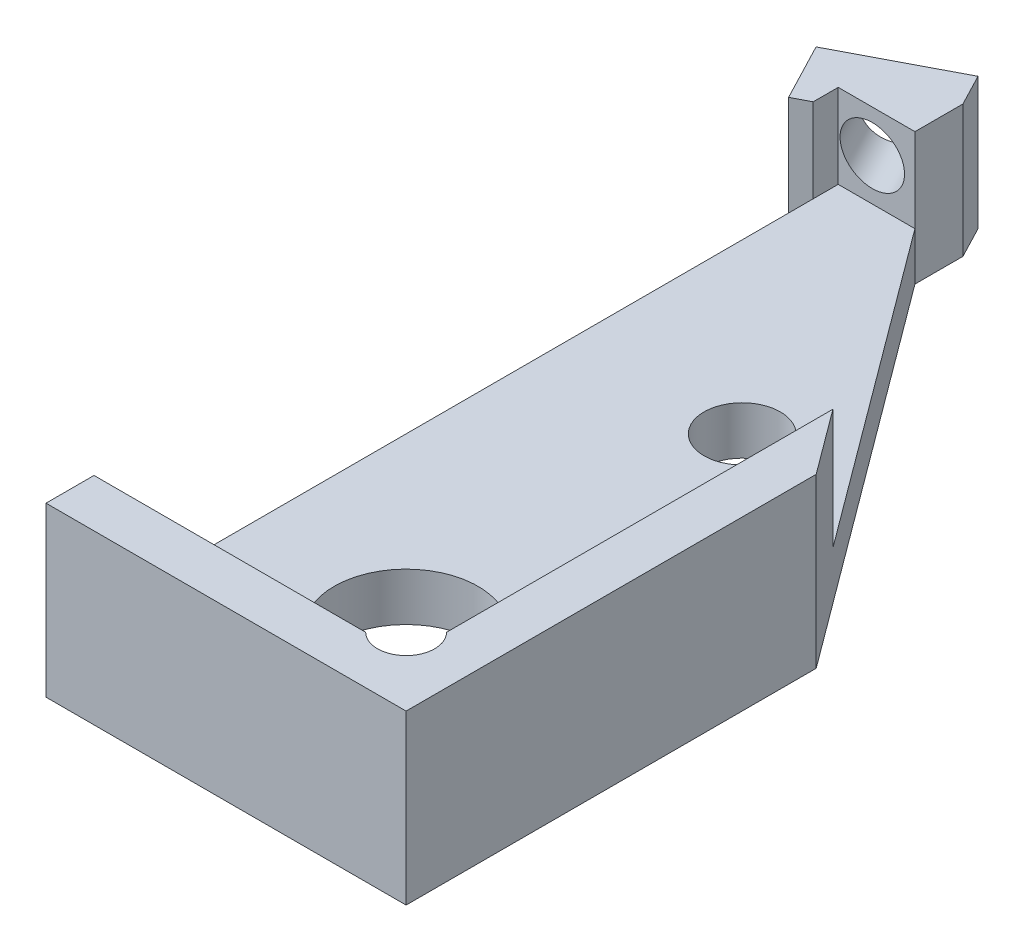
ISO-10303-21;
HEADER;
FILE_DESCRIPTION(('STEP AP214'),'2;1');
FILE_NAME('part.step','',(''),(''),'','','');
FILE_SCHEMA(('AUTOMOTIVE_DESIGN { 1 0 10303 214 1 1 1 1 }'));
ENDSEC;
DATA;
#1=APPLICATION_CONTEXT('core data for automotive mechanical design processes');
#2=APPLICATION_PROTOCOL_DEFINITION('international standard','automotive_design',2000,#1);
#3=PRODUCT_CONTEXT('',#1,'mechanical');
#4=PRODUCT('Part','Part','',(#3));
#5=PRODUCT_RELATED_PRODUCT_CATEGORY('part','',(#4));
#6=PRODUCT_DEFINITION_FORMATION('','',#4);
#7=PRODUCT_DEFINITION_CONTEXT('part definition',#1,'design');
#8=PRODUCT_DEFINITION('design','',#6,#7);
#9=PRODUCT_DEFINITION_SHAPE('','',#8);
#10=(LENGTH_UNIT() NAMED_UNIT(*) SI_UNIT(.MILLI.,.METRE.));
#11=(NAMED_UNIT(*) PLANE_ANGLE_UNIT() SI_UNIT($,.RADIAN.));
#12=(NAMED_UNIT(*) SI_UNIT($,.STERADIAN.) SOLID_ANGLE_UNIT());
#13=UNCERTAINTY_MEASURE_WITH_UNIT(LENGTH_MEASURE(1.E-05),#10,'distance_accuracy_value','');
#14=(GEOMETRIC_REPRESENTATION_CONTEXT(3) GLOBAL_UNCERTAINTY_ASSIGNED_CONTEXT((#13)) GLOBAL_UNIT_ASSIGNED_CONTEXT((#10,
#11,#12)) REPRESENTATION_CONTEXT('',''));
#15=CARTESIAN_POINT('',(0.,0.,0.));
#16=DIRECTION('',(0.,0.,1.));
#17=DIRECTION('',(1.,0.,0.));
#18=AXIS2_PLACEMENT_3D('',#15,#16,#17);
#19=CARTESIAN_POINT('',(0.,3.5,0.));
#20=DIRECTION('',(0.,-1.,0.));
#21=DIRECTION('',(0.,0.,-1.));
#22=AXIS2_PLACEMENT_3D('',#19,#20,#21);
#23=PLANE('',#22);
#24=DIRECTION('',(1.,0.,0.));
#25=VECTOR('',#24,1.);
#26=CARTESIAN_POINT('',(2.75,3.5,7.75));
#27=LINE('',#26,#25);
#28=CARTESIAN_POINT('',(-3.75,3.5,7.75));
#29=VERTEX_POINT('',#28);
#30=CARTESIAN_POINT('',(1.90810098864976,3.5,7.75));
#31=VERTEX_POINT('',#30);
#32=EDGE_CURVE('E255',#29,#31,#27,.T.);
#33=ORIENTED_EDGE('',*,*,#32,.F.);
#34=DIRECTION('',(0.,0.,1.));
#35=VECTOR('',#34,1.);
#36=CARTESIAN_POINT('',(-3.75,3.5,-8.75));
#37=LINE('',#36,#35);
#38=CARTESIAN_POINT('',(-3.75,3.5,8.75));
#39=VERTEX_POINT('',#38);
#40=EDGE_CURVE('E267',#29,#39,#37,.T.);
#41=ORIENTED_EDGE('',*,*,#40,.T.);
#42=DIRECTION('',(1.,0.,0.));
#43=VECTOR('',#42,1.);
#44=CARTESIAN_POINT('',(3.75,3.5,8.75));
#45=LINE('',#44,#43);
#46=CARTESIAN_POINT('',(3.75,3.5,8.75));
#47=VERTEX_POINT('',#46);
#48=EDGE_CURVE('E269',#39,#47,#45,.T.);
#49=ORIENTED_EDGE('',*,*,#48,.T.);
#50=DIRECTION('',(0.,0.,-1.));
#51=VECTOR('',#50,1.);
#52=CARTESIAN_POINT('',(3.75,3.5,-8.75));
#53=LINE('',#52,#51);
#54=CARTESIAN_POINT('',(3.75,3.5,0.208562074203243));
#55=VERTEX_POINT('',#54);
#56=EDGE_CURVE('E272',#47,#55,#53,.T.);
#57=ORIENTED_EDGE('',*,*,#56,.T.);
#58=DIRECTION('',(0.595668713356042,0.,0.803230218510707));
#59=VECTOR('',#58,1.);
#60=CARTESIAN_POINT('',(2.31963201516526,3.5,-1.72021941666348));
#61=LINE('',#60,#59);
#62=CARTESIAN_POINT('',(2.75,3.5,-1.13988917143168));
#63=VERTEX_POINT('',#62);
#64=EDGE_CURVE('E189',#63,#55,#61,.T.);
#65=ORIENTED_EDGE('',*,*,#64,.F.);
#66=DIRECTION('',(0.,0.,-1.));
#67=VECTOR('',#66,1.);
#68=CARTESIAN_POINT('',(2.75,3.5,-7.75));
#69=LINE('',#68,#67);
#70=CARTESIAN_POINT('',(2.75,3.5,6.90810098864977));
#71=VERTEX_POINT('',#70);
#72=EDGE_CURVE('E258',#71,#63,#69,.T.);
#73=ORIENTED_EDGE('',*,*,#72,.F.);
#74=CARTESIAN_POINT('',(2.32905049432488,3.5,7.32905049432488));
#75=DIRECTION('',(0.,1.,0.));
#76=DIRECTION('',(0.,0.,1.));
#77=AXIS2_PLACEMENT_3D('',#74,#75,#76);
#78=CIRCLE('',#77,0.595312500000001);
#79=EDGE_CURVE('E57',#31,#71,#78,.T.);
#80=ORIENTED_EDGE('',*,*,#79,.F.);
#81=EDGE_LOOP('',(#33,#41,#49,#57,#65,#73,#80));
#82=FACE_BOUND('',#81,.T.);
#83=ADVANCED_FACE('F34',(#82),#23,.F.);
#84=CARTESIAN_POINT('',(0.,2.75,0.));
#85=DIRECTION('',(0.,-1.,0.));
#86=DIRECTION('',(0.,0.,-1.));
#87=AXIS2_PLACEMENT_3D('',#84,#85,#86);
#88=PLANE('',#87);
#89=DIRECTION('',(0.,0.,1.));
#90=VECTOR('',#89,1.);
#91=CARTESIAN_POINT('',(-3.75,2.75,0.));
#92=LINE('',#91,#90);
#93=CARTESIAN_POINT('',(-3.75,2.75,-7.75));
#94=VERTEX_POINT('',#93);
#95=CARTESIAN_POINT('',(-3.75,2.75,-7.22820528636593));
#96=VERTEX_POINT('',#95);
#97=EDGE_CURVE('E163',#94,#96,#92,.T.);
#98=ORIENTED_EDGE('',*,*,#97,.F.);
#99=DIRECTION('',(-1.,0.,0.));
#100=VECTOR('',#99,1.);
#101=CARTESIAN_POINT('',(2.75,2.75,-7.75));
#102=LINE('',#101,#100);
#103=CARTESIAN_POINT('',(-2.15200209311677,2.75,-7.75));
#104=VERTEX_POINT('',#103);
#105=EDGE_CURVE('E160',#104,#94,#102,.T.);
#106=ORIENTED_EDGE('',*,*,#105,.F.);
#107=DIRECTION('',(0.,0.,1.));
#108=VECTOR('',#107,1.);
#109=CARTESIAN_POINT('',(-2.15200209311678,2.75,0.));
#110=LINE('',#109,#108);
#111=CARTESIAN_POINT('',(-2.15200209311677,2.75,-8.75));
#112=VERTEX_POINT('',#111);
#113=EDGE_CURVE('E12',#112,#104,#110,.T.);
#114=ORIENTED_EDGE('',*,*,#113,.F.);
#115=DIRECTION('',(-0.462604740450131,0.,-0.886564636173284));
#116=VECTOR('',#115,1.);
#117=CARTESIAN_POINT('',(-2.49397867231052,2.75,-9.40538528900002));
#118=LINE('',#117,#116);
#119=CARTESIAN_POINT('',(-2.49397867231052,2.75,-9.40538528900002));
#120=VERTEX_POINT('',#119);
#121=EDGE_CURVE('E201',#112,#120,#118,.T.);
#122=ORIENTED_EDGE('',*,*,#121,.T.);
#123=DIRECTION('',(-0.886564636173283,0.,0.462604740450132));
#124=VECTOR('',#123,1.);
#125=CARTESIAN_POINT('',(-2.49397867231052,2.75,-9.40538528900002));
#126=LINE('',#125,#124);
#127=CARTESIAN_POINT('',(-4.71039026274373,2.75,-8.24887343787469));
#128=VERTEX_POINT('',#127);
#129=EDGE_CURVE('E49',#120,#128,#126,.T.);
#130=ORIENTED_EDGE('',*,*,#129,.T.);
#131=DIRECTION('',(0.462604740450133,0.,0.886564636173283));
#132=VECTOR('',#131,1.);
#133=CARTESIAN_POINT('',(-4.08625811344759,2.75,-7.05274758035242));
#134=LINE('',#133,#132);
#135=CARTESIAN_POINT('',(-4.08625811344759,2.75,-7.05274758035242));
#136=VERTEX_POINT('',#135);
#137=EDGE_CURVE('E42',#128,#136,#134,.T.);
#138=ORIENTED_EDGE('',*,*,#137,.T.);
#139=DIRECTION('',(0.886564636173283,0.,-0.462604740450133));
#140=VECTOR('',#139,1.);
#141=CARTESIAN_POINT('',(-1.86984652301438,2.75,-8.20925943147775));
#142=LINE('',#141,#140);
#143=EDGE_CURVE('E197',#136,#96,#142,.T.);
#144=ORIENTED_EDGE('',*,*,#143,.T.);
#145=EDGE_LOOP('',(#98,#106,#114,#122,#130,#138,#144));
#146=FACE_BOUND('',#145,.T.);
#147=ADVANCED_FACE('F288',(#146),#88,.F.);
#148=CARTESIAN_POINT('',(-3.75,3.5,-8.75));
#149=DIRECTION('',(1.,0.,0.));
#150=DIRECTION('',(0.,0.,-1.));
#151=AXIS2_PLACEMENT_3D('',#148,#149,#150);
#152=PLANE('',#151);
#153=DIRECTION('',(0.,-1.,0.));
#154=VECTOR('',#153,1.);
#155=CARTESIAN_POINT('',(-3.75,4.,7.75));
#156=LINE('',#155,#154);
#157=CARTESIAN_POINT('',(-3.75,1.,7.75));
#158=VERTEX_POINT('',#157);
#159=EDGE_CURVE('E164',#29,#158,#156,.T.);
#160=ORIENTED_EDGE('',*,*,#159,.T.);
#161=DIRECTION('',(0.,0.,1.));
#162=VECTOR('',#161,1.);
#163=CARTESIAN_POINT('',(-3.75,1.,7.75));
#164=LINE('',#163,#162);
#165=CARTESIAN_POINT('',(-3.75,1.,-7.22820528636593));
#166=VERTEX_POINT('',#165);
#167=EDGE_CURVE('E169',#166,#158,#164,.T.);
#168=ORIENTED_EDGE('',*,*,#167,.F.);
#169=DIRECTION('',(0.,-1.,0.));
#170=VECTOR('',#169,1.);
#171=CARTESIAN_POINT('',(-3.75,3.5,-7.22820528636593));
#172=LINE('',#171,#170);
#173=CARTESIAN_POINT('',(-3.75,0.,-7.22820528636593));
#174=VERTEX_POINT('',#173);
#175=EDGE_CURVE('E223',#166,#174,#172,.T.);
#176=ORIENTED_EDGE('',*,*,#175,.T.);
#177=DIRECTION('',(0.,0.,1.));
#178=VECTOR('',#177,1.);
#179=CARTESIAN_POINT('',(-3.75,0.,-8.75));
#180=LINE('',#179,#178);
#181=CARTESIAN_POINT('',(-3.75,0.,8.75));
#182=VERTEX_POINT('',#181);
#183=EDGE_CURVE('E153',#174,#182,#180,.T.);
#184=ORIENTED_EDGE('',*,*,#183,.T.);
#185=DIRECTION('',(0.,-1.,0.));
#186=VECTOR('',#185,1.);
#187=CARTESIAN_POINT('',(-3.75,3.5,8.75));
#188=LINE('',#187,#186);
#189=EDGE_CURVE('E283',#39,#182,#188,.T.);
#190=ORIENTED_EDGE('',*,*,#189,.F.);
#191=ORIENTED_EDGE('',*,*,#40,.F.);
#192=EDGE_LOOP('',(#160,#168,#176,#184,#190,#191));
#193=FACE_BOUND('',#192,.T.);
#194=ADVANCED_FACE('F36',(#193),#152,.F.);
#195=CARTESIAN_POINT('',(-3.60218446752712,1.875,-8.82712936343735));
#196=DIRECTION('',(-0.462604740450132,0.,-0.886564636173283));
#197=DIRECTION('',(-0.886564636173283,0.,0.462604740450132));
#198=AXIS2_PLACEMENT_3D('',#195,#196,#197);
#199=CYLINDRICAL_SURFACE('',#198,0.595629999999999);
#200=CARTESIAN_POINT('',(-3.60218446752712,1.875,-8.82712936343735));
#201=DIRECTION('',(-0.462604740450132,0.,-0.886564636173283));
#202=DIRECTION('',(-0.886564636173283,0.,0.462604740450132));
#203=AXIS2_PLACEMENT_3D('',#200,#201,#202);
#204=CIRCLE('',#203,0.595629999999999);
#205=CARTESIAN_POINT('',(-4.13024896177101,1.875,-8.55158810188304));
#206=VERTEX_POINT('',#205);
#207=EDGE_CURVE('E191',#206,#206,#204,.T.);
#208=ORIENTED_EDGE('',*,*,#207,.T.);
#209=EDGE_LOOP('',(#208));
#210=FACE_BOUND('',#209,.T.);
#211=CARTESIAN_POINT('',(-3.04014405978548,1.875,-7.75));
#212=DIRECTION('',(0.,0.,-1.));
#213=DIRECTION('',(-1.,0.,0.));
#214=AXIS2_PLACEMENT_3D('',#211,#212,#213);
#215=ELLIPSE('',#214,0.671840467910994,0.595629999999999);
#216=CARTESIAN_POINT('',(-3.71198452769648,1.875,-7.75));
#217=VERTEX_POINT('',#216);
#218=EDGE_CURVE('E194',#217,#217,#215,.T.);
#219=ORIENTED_EDGE('',*,*,#218,.F.);
#220=EDGE_LOOP('',(#219));
#221=FACE_BOUND('',#220,.T.);
#222=ADVANCED_FACE('F360',(#210,#221),#199,.F.);
#223=CARTESIAN_POINT('',(3.75,3.5,-8.75));
#224=DIRECTION('',(-1.,0.,0.));
#225=DIRECTION('',(0.,0.,1.));
#226=AXIS2_PLACEMENT_3D('',#223,#224,#225);
#227=PLANE('',#226);
#228=DIRECTION('',(0.,-1.,0.));
#229=VECTOR('',#228,1.);
#230=CARTESIAN_POINT('',(3.75,5.,0.208562074203243));
#231=LINE('',#230,#229);
#232=CARTESIAN_POINT('',(3.75,0.,0.208562074203243));
#233=VERTEX_POINT('',#232);
#234=EDGE_CURVE('E184',#55,#233,#231,.T.);
#235=ORIENTED_EDGE('',*,*,#234,.F.);
#236=ORIENTED_EDGE('',*,*,#56,.F.);
#237=DIRECTION('',(0.,-1.,0.));
#238=VECTOR('',#237,1.);
#239=CARTESIAN_POINT('',(3.75,3.5,8.75));
#240=LINE('',#239,#238);
#241=CARTESIAN_POINT('',(3.75,0.,8.75));
#242=VERTEX_POINT('',#241);
#243=EDGE_CURVE('E275',#47,#242,#240,.T.);
#244=ORIENTED_EDGE('',*,*,#243,.T.);
#245=DIRECTION('',(0.,0.,-1.));
#246=VECTOR('',#245,1.);
#247=CARTESIAN_POINT('',(3.75,0.,-8.75));
#248=LINE('',#247,#246);
#249=EDGE_CURVE('E270',#242,#233,#248,.T.);
#250=ORIENTED_EDGE('',*,*,#249,.T.);
#251=EDGE_LOOP('',(#235,#236,#244,#250));
#252=FACE_BOUND('',#251,.T.);
#253=ADVANCED_FACE('F357',(#252),#227,.F.);
#254=CARTESIAN_POINT('',(0.,0.,0.));
#255=DIRECTION('',(0.,-1.,0.));
#256=DIRECTION('',(0.,0.,-1.));
#257=AXIS2_PLACEMENT_3D('',#254,#255,#256);
#258=PLANE('',#257);
#259=CARTESIAN_POINT('',(1.625,0.,6.5));
#260=DIRECTION('',(0.,1.,0.));
#261=DIRECTION('',(0.,0.,1.));
#262=AXIS2_PLACEMENT_3D('',#259,#260,#261);
#263=CIRCLE('',#262,0.79375);
#264=CARTESIAN_POINT('',(1.625,0.,7.29375));
#265=VERTEX_POINT('',#264);
#266=EDGE_CURVE('E228',#265,#265,#263,.T.);
#267=ORIENTED_EDGE('',*,*,#266,.T.);
#268=EDGE_LOOP('',(#267));
#269=FACE_BOUND('',#268,.T.);
#270=CARTESIAN_POINT('',(-2.125,0.,6.5));
#271=DIRECTION('',(0.,1.,0.));
#272=DIRECTION('',(0.,0.,1.));
#273=AXIS2_PLACEMENT_3D('',#270,#271,#272);
#274=CIRCLE('',#273,0.793750000000001);
#275=CARTESIAN_POINT('',(-2.125,0.,7.29375));
#276=VERTEX_POINT('',#275);
#277=EDGE_CURVE('E234',#276,#276,#274,.T.);
#278=ORIENTED_EDGE('',*,*,#277,.T.);
#279=EDGE_LOOP('',(#278));
#280=FACE_BOUND('',#279,.T.);
#281=CARTESIAN_POINT('',(-0.250000000000001,0.,-2.25));
#282=DIRECTION('',(0.,1.,0.));
#283=DIRECTION('',(0.,0.,1.));
#284=AXIS2_PLACEMENT_3D('',#281,#282,#283);
#285=CIRCLE('',#284,0.79375);
#286=CARTESIAN_POINT('',(-0.250000000000001,0.,-1.45625));
#287=VERTEX_POINT('',#286);
#288=EDGE_CURVE('E240',#287,#287,#285,.T.);
#289=ORIENTED_EDGE('',*,*,#288,.T.);
#290=EDGE_LOOP('',(#289));
#291=FACE_BOUND('',#290,.T.);
#292=CARTESIAN_POINT('',(-0.25,0.,4.75));
#293=DIRECTION('',(0.,1.,0.));
#294=DIRECTION('',(0.,0.,1.));
#295=AXIS2_PLACEMENT_3D('',#292,#293,#294);
#296=CIRCLE('',#295,1.5);
#297=CARTESIAN_POINT('',(-0.25,0.,6.25));
#298=VERTEX_POINT('',#297);
#299=EDGE_CURVE('E252',#298,#298,#296,.T.);
#300=ORIENTED_EDGE('',*,*,#299,.T.);
#301=EDGE_LOOP('',(#300));
#302=FACE_BOUND('',#301,.T.);
#303=DIRECTION('',(0.,0.,1.));
#304=VECTOR('',#303,1.);
#305=CARTESIAN_POINT('',(-2.15200209311677,0.,-9.31323554731023));
#306=LINE('',#305,#304);
#307=CARTESIAN_POINT('',(-2.15200209311677,0.,-8.75));
#308=VERTEX_POINT('',#307);
#309=CARTESIAN_POINT('',(-2.15200209311677,0.,-7.75));
#310=VERTEX_POINT('',#309);
#311=EDGE_CURVE('E178',#308,#310,#306,.T.);
#312=ORIENTED_EDGE('',*,*,#311,.T.);
#313=DIRECTION('',(0.595668713356042,0.,0.803230218510707));
#314=VECTOR('',#313,1.);
#315=CARTESIAN_POINT('',(-2.15200209311677,0.,-7.75));
#316=LINE('',#315,#314);
#317=EDGE_CURVE('E175',#310,#233,#316,.T.);
#318=ORIENTED_EDGE('',*,*,#317,.T.);
#319=ORIENTED_EDGE('',*,*,#249,.F.);
#320=DIRECTION('',(1.,0.,0.));
#321=VECTOR('',#320,1.);
#322=CARTESIAN_POINT('',(3.75,0.,8.75));
#323=LINE('',#322,#321);
#324=EDGE_CURVE('E277',#182,#242,#323,.T.);
#325=ORIENTED_EDGE('',*,*,#324,.F.);
#326=ORIENTED_EDGE('',*,*,#183,.F.);
#327=DIRECTION('',(0.886564636173283,0.,-0.462604740450133));
#328=VECTOR('',#327,1.);
#329=CARTESIAN_POINT('',(-1.86984652301438,0.,-8.20925943147775));
#330=LINE('',#329,#328);
#331=CARTESIAN_POINT('',(-4.08625811344759,0.,-7.05274758035242));
#332=VERTEX_POINT('',#331);
#333=EDGE_CURVE('E210',#332,#174,#330,.T.);
#334=ORIENTED_EDGE('',*,*,#333,.F.);
#335=DIRECTION('',(0.462604740450133,0.,0.886564636173283));
#336=VECTOR('',#335,1.);
#337=CARTESIAN_POINT('',(-4.08625811344759,0.,-7.05274758035242));
#338=LINE('',#337,#336);
#339=CARTESIAN_POINT('',(-4.71039026274373,0.,-8.24887343787469));
#340=VERTEX_POINT('',#339);
#341=EDGE_CURVE('E214',#340,#332,#338,.T.);
#342=ORIENTED_EDGE('',*,*,#341,.F.);
#343=DIRECTION('',(-0.886564636173283,0.,0.462604740450132));
#344=VECTOR('',#343,1.);
#345=CARTESIAN_POINT('',(-2.49397867231052,0.,-9.40538528900002));
#346=LINE('',#345,#344);
#347=CARTESIAN_POINT('',(-2.49397867231052,0.,-9.40538528900002));
#348=VERTEX_POINT('',#347);
#349=EDGE_CURVE('E204',#348,#340,#346,.T.);
#350=ORIENTED_EDGE('',*,*,#349,.F.);
#351=DIRECTION('',(-0.462604740450131,0.,-0.886564636173284));
#352=VECTOR('',#351,1.);
#353=CARTESIAN_POINT('',(-2.49397867231052,0.,-9.40538528900002));
#354=LINE('',#353,#352);
#355=EDGE_CURVE('E207',#308,#348,#354,.T.);
#356=ORIENTED_EDGE('',*,*,#355,.F.);
#357=EDGE_LOOP('',(#312,#318,#319,#325,#326,#334,#342,#350,#356));
#358=FACE_BOUND('',#357,.T.);
#359=ADVANCED_FACE('F299',(#269,#280,#291,#302,#358),#258,.T.);
#360=CARTESIAN_POINT('',(0.,1.,0.));
#361=DIRECTION('',(0.,-1.,0.));
#362=DIRECTION('',(0.,0.,-1.));
#363=AXIS2_PLACEMENT_3D('',#360,#361,#362);
#364=PLANE('',#363);
#365=CARTESIAN_POINT('',(-2.125,1.,6.5));
#366=DIRECTION('',(0.,1.,0.));
#367=DIRECTION('',(0.,0.,1.));
#368=AXIS2_PLACEMENT_3D('',#365,#366,#367);
#369=CIRCLE('',#368,0.793750000000001);
#370=CARTESIAN_POINT('',(-2.125,1.,7.29375));
#371=VERTEX_POINT('',#370);
#372=EDGE_CURVE('E231',#371,#371,#369,.T.);
#373=ORIENTED_EDGE('',*,*,#372,.F.);
#374=EDGE_LOOP('',(#373));
#375=FACE_BOUND('',#374,.T.);
#376=CARTESIAN_POINT('',(-0.25,1.,4.75));
#377=DIRECTION('',(0.,1.,0.));
#378=DIRECTION('',(0.,0.,1.));
#379=AXIS2_PLACEMENT_3D('',#376,#377,#378);
#380=CIRCLE('',#379,1.5);
#381=CARTESIAN_POINT('',(-0.25,1.,6.25));
#382=VERTEX_POINT('',#381);
#383=EDGE_CURVE('E251',#382,#382,#380,.T.);
#384=ORIENTED_EDGE('',*,*,#383,.F.);
#385=EDGE_LOOP('',(#384));
#386=FACE_BOUND('',#385,.T.);
#387=CARTESIAN_POINT('',(-0.250000000000001,1.,-2.25));
#388=DIRECTION('',(0.,1.,0.));
#389=DIRECTION('',(0.,0.,1.));
#390=AXIS2_PLACEMENT_3D('',#387,#388,#389);
#391=CIRCLE('',#390,0.79375);
#392=CARTESIAN_POINT('',(-0.250000000000001,1.,-1.45625));
#393=VERTEX_POINT('',#392);
#394=EDGE_CURVE('E237',#393,#393,#391,.T.);
#395=ORIENTED_EDGE('',*,*,#394,.F.);
#396=EDGE_LOOP('',(#395));
#397=FACE_BOUND('',#396,.T.);
#398=CARTESIAN_POINT('',(1.625,1.,6.5));
#399=DIRECTION('',(0.,1.,0.));
#400=DIRECTION('',(0.,0.,1.));
#401=AXIS2_PLACEMENT_3D('',#398,#399,#400);
#402=CIRCLE('',#401,0.79375);
#403=CARTESIAN_POINT('',(1.625,1.,7.29375));
#404=VERTEX_POINT('',#403);
#405=EDGE_CURVE('E227',#404,#404,#402,.T.);
#406=ORIENTED_EDGE('',*,*,#405,.F.);
#407=EDGE_LOOP('',(#406));
#408=FACE_BOUND('',#407,.T.);
#409=DIRECTION('',(0.595668713356042,0.,0.803230218510707));
#410=VECTOR('',#409,1.);
#411=CARTESIAN_POINT('',(2.31963201516526,1.,-1.72021941666348));
#412=LINE('',#411,#410);
#413=CARTESIAN_POINT('',(-2.15200209311677,0.999999999999994,-7.75));
#414=VERTEX_POINT('',#413);
#415=CARTESIAN_POINT('',(2.75,0.999999999999994,-1.13988917143168));
#416=VERTEX_POINT('',#415);
#417=EDGE_CURVE('E150',#414,#416,#412,.T.);
#418=ORIENTED_EDGE('',*,*,#417,.F.);
#419=DIRECTION('',(-1.,0.,0.));
#420=VECTOR('',#419,1.);
#421=CARTESIAN_POINT('',(2.75,1.,-7.75));
#422=LINE('',#421,#420);
#423=CARTESIAN_POINT('',(-3.75,1.,-7.75));
#424=VERTEX_POINT('',#423);
#425=EDGE_CURVE('E142',#414,#424,#422,.T.);
#426=ORIENTED_EDGE('',*,*,#425,.T.);
#427=EDGE_CURVE('E147',#424,#166,#164,.T.);
#428=ORIENTED_EDGE('',*,*,#427,.T.);
#429=ORIENTED_EDGE('',*,*,#167,.T.);
#430=DIRECTION('',(1.,0.,0.));
#431=VECTOR('',#430,1.);
#432=CARTESIAN_POINT('',(2.75,1.,7.75));
#433=LINE('',#432,#431);
#434=CARTESIAN_POINT('',(1.90810098864976,1.,7.75));
#435=VERTEX_POINT('',#434);
#436=EDGE_CURVE('E261',#158,#435,#433,.T.);
#437=ORIENTED_EDGE('',*,*,#436,.T.);
#438=CARTESIAN_POINT('',(2.32905049432488,1.,7.32905049432488));
#439=DIRECTION('',(0.,-1.,0.));
#440=DIRECTION('',(0.,0.,-1.));
#441=AXIS2_PLACEMENT_3D('',#438,#439,#440);
#442=CIRCLE('',#441,0.595312500000001);
#443=CARTESIAN_POINT('',(2.75,1.,6.90810098864977));
#444=VERTEX_POINT('',#443);
#445=EDGE_CURVE('E246',#435,#444,#442,.F.);
#446=ORIENTED_EDGE('',*,*,#445,.T.);
#447=DIRECTION('',(0.,0.,-1.));
#448=VECTOR('',#447,1.);
#449=CARTESIAN_POINT('',(2.75,1.,-7.75));
#450=LINE('',#449,#448);
#451=EDGE_CURVE('E154',#444,#416,#450,.T.);
#452=ORIENTED_EDGE('',*,*,#451,.T.);
#453=EDGE_LOOP('',(#418,#426,#428,#429,#437,#446,#452));
#454=FACE_BOUND('',#453,.T.);
#455=ADVANCED_FACE('F144',(#375,#386,#397,#408,#454),#364,.F.);
#456=CARTESIAN_POINT('',(2.75,-16.4468842033985,-7.75));
#457=DIRECTION('',(1.,0.,0.));
#458=DIRECTION('',(0.,0.,-1.));
#459=AXIS2_PLACEMENT_3D('',#456,#457,#458);
#460=PLANE('',#459);
#461=DIRECTION('',(0.,1.,0.));
#462=VECTOR('',#461,1.);
#463=CARTESIAN_POINT('',(2.75,-16.4468842033985,-1.13988917143168));
#464=LINE('',#463,#462);
#465=EDGE_CURVE('E186',#416,#63,#464,.T.);
#466=ORIENTED_EDGE('',*,*,#465,.F.);
#467=ORIENTED_EDGE('',*,*,#451,.F.);
#468=DIRECTION('',(0.,1.,0.));
#469=VECTOR('',#468,1.);
#470=CARTESIAN_POINT('',(2.75,-0.683798022700471,6.90810098864977));
#471=LINE('',#470,#469);
#472=EDGE_CURVE('E286',#444,#71,#471,.T.);
#473=ORIENTED_EDGE('',*,*,#472,.T.);
#474=ORIENTED_EDGE('',*,*,#72,.T.);
#475=EDGE_LOOP('',(#466,#467,#473,#474));
#476=FACE_BOUND('',#475,.T.);
#477=ADVANCED_FACE('F316',(#476),#460,.F.);
#478=CARTESIAN_POINT('',(2.75,-16.4468842033985,-7.75));
#479=DIRECTION('',(0.,0.,-1.));
#480=DIRECTION('',(-1.,0.,0.));
#481=AXIS2_PLACEMENT_3D('',#478,#479,#480);
#482=PLANE('',#481);
#483=ORIENTED_EDGE('',*,*,#218,.T.);
#484=EDGE_LOOP('',(#483));
#485=FACE_BOUND('',#484,.T.);
#486=DIRECTION('',(0.,-1.,0.));
#487=VECTOR('',#486,1.);
#488=CARTESIAN_POINT('',(-2.15200209311677,5.,-7.75));
#489=LINE('',#488,#487);
#490=EDGE_CURVE('E183',#104,#414,#489,.T.);
#491=ORIENTED_EDGE('',*,*,#490,.F.);
#492=ORIENTED_EDGE('',*,*,#105,.T.);
#493=DIRECTION('',(0.,-1.,0.));
#494=VECTOR('',#493,1.);
#495=CARTESIAN_POINT('',(-3.75,4.,-7.75));
#496=LINE('',#495,#494);
#497=EDGE_CURVE('E157',#94,#424,#496,.T.);
#498=ORIENTED_EDGE('',*,*,#497,.T.);
#499=ORIENTED_EDGE('',*,*,#425,.F.);
#500=EDGE_LOOP('',(#491,#492,#498,#499));
#501=FACE_BOUND('',#500,.T.);
#502=ADVANCED_FACE('F158',(#485,#501),#482,.F.);
#503=CARTESIAN_POINT('',(3.75,3.5,8.75));
#504=DIRECTION('',(0.,0.,-1.));
#505=DIRECTION('',(-1.,0.,0.));
#506=AXIS2_PLACEMENT_3D('',#503,#504,#505);
#507=PLANE('',#506);
#508=ORIENTED_EDGE('',*,*,#324,.T.);
#509=ORIENTED_EDGE('',*,*,#243,.F.);
#510=ORIENTED_EDGE('',*,*,#48,.F.);
#511=ORIENTED_EDGE('',*,*,#189,.T.);
#512=EDGE_LOOP('',(#508,#509,#510,#511));
#513=FACE_BOUND('',#512,.T.);
#514=ADVANCED_FACE('F362',(#513),#507,.F.);
#515=CARTESIAN_POINT('',(2.75,-16.4468842033985,7.75));
#516=DIRECTION('',(0.,0.,1.));
#517=DIRECTION('',(1.,0.,0.));
#518=AXIS2_PLACEMENT_3D('',#515,#516,#517);
#519=PLANE('',#518);
#520=ORIENTED_EDGE('',*,*,#32,.T.);
#521=DIRECTION('',(0.,1.,0.));
#522=VECTOR('',#521,1.);
#523=CARTESIAN_POINT('',(1.90810098864976,-0.683798022700471,7.75));
#524=LINE('',#523,#522);
#525=EDGE_CURVE('E248',#31,#435,#524,.F.);
#526=ORIENTED_EDGE('',*,*,#525,.T.);
#527=ORIENTED_EDGE('',*,*,#436,.F.);
#528=ORIENTED_EDGE('',*,*,#159,.F.);
#529=EDGE_LOOP('',(#520,#526,#527,#528));
#530=FACE_BOUND('',#529,.T.);
#531=ADVANCED_FACE('F309',(#530),#519,.F.);
#532=CARTESIAN_POINT('',(-0.25,0.,4.75));
#533=DIRECTION('',(0.,1.,0.));
#534=DIRECTION('',(0.,0.,1.));
#535=AXIS2_PLACEMENT_3D('',#532,#533,#534);
#536=CYLINDRICAL_SURFACE('',#535,1.5);
#537=ORIENTED_EDGE('',*,*,#299,.F.);
#538=EDGE_LOOP('',(#537));
#539=FACE_BOUND('',#538,.T.);
#540=ORIENTED_EDGE('',*,*,#383,.T.);
#541=EDGE_LOOP('',(#540));
#542=FACE_BOUND('',#541,.T.);
#543=ADVANCED_FACE('F369',(#539,#542),#536,.F.);
#544=CARTESIAN_POINT('',(2.32905049432488,-0.683798022700471,7.32905049432488));
#545=DIRECTION('',(0.,1.,0.));
#546=DIRECTION('',(0.,0.,1.));
#547=AXIS2_PLACEMENT_3D('',#544,#545,#546);
#548=CYLINDRICAL_SURFACE('',#547,0.595312500000001);
#549=ORIENTED_EDGE('',*,*,#79,.T.);
#550=ORIENTED_EDGE('',*,*,#472,.F.);
#551=ORIENTED_EDGE('',*,*,#445,.F.);
#552=ORIENTED_EDGE('',*,*,#525,.F.);
#553=EDGE_LOOP('',(#549,#550,#551,#552));
#554=FACE_BOUND('',#553,.T.);
#555=ADVANCED_FACE('F310',(#554),#548,.F.);
#556=CARTESIAN_POINT('',(-0.250000000000001,0.,-2.25));
#557=DIRECTION('',(0.,1.,0.));
#558=DIRECTION('',(0.,0.,1.));
#559=AXIS2_PLACEMENT_3D('',#556,#557,#558);
#560=CYLINDRICAL_SURFACE('',#559,0.79375);
#561=ORIENTED_EDGE('',*,*,#288,.F.);
#562=EDGE_LOOP('',(#561));
#563=FACE_BOUND('',#562,.T.);
#564=ORIENTED_EDGE('',*,*,#394,.T.);
#565=EDGE_LOOP('',(#564));
#566=FACE_BOUND('',#565,.T.);
#567=ADVANCED_FACE('F386',(#563,#566),#560,.F.);
#568=CARTESIAN_POINT('',(-2.125,0.,6.5));
#569=DIRECTION('',(0.,1.,0.));
#570=DIRECTION('',(0.,0.,1.));
#571=AXIS2_PLACEMENT_3D('',#568,#569,#570);
#572=CYLINDRICAL_SURFACE('',#571,0.793750000000001);
#573=ORIENTED_EDGE('',*,*,#277,.F.);
#574=EDGE_LOOP('',(#573));
#575=FACE_BOUND('',#574,.T.);
#576=ORIENTED_EDGE('',*,*,#372,.T.);
#577=EDGE_LOOP('',(#576));
#578=FACE_BOUND('',#577,.T.);
#579=ADVANCED_FACE('F341',(#575,#578),#572,.F.);
#580=CARTESIAN_POINT('',(1.625,0.,6.5));
#581=DIRECTION('',(0.,1.,0.));
#582=DIRECTION('',(0.,0.,1.));
#583=AXIS2_PLACEMENT_3D('',#580,#581,#582);
#584=CYLINDRICAL_SURFACE('',#583,0.79375);
#585=ORIENTED_EDGE('',*,*,#266,.F.);
#586=EDGE_LOOP('',(#585));
#587=FACE_BOUND('',#586,.T.);
#588=ORIENTED_EDGE('',*,*,#405,.T.);
#589=EDGE_LOOP('',(#588));
#590=FACE_BOUND('',#589,.T.);
#591=ADVANCED_FACE('F333',(#587,#590),#584,.F.);
#592=CARTESIAN_POINT('',(-2.49397867231052,-3.68830488510185,-9.40538528900002));
#593=DIRECTION('',(-0.462604740450132,0.,-0.886564636173283));
#594=DIRECTION('',(-0.886564636173283,0.,0.462604740450132));
#595=AXIS2_PLACEMENT_3D('',#592,#593,#594);
#596=PLANE('',#595);
#597=ORIENTED_EDGE('',*,*,#207,.F.);
#598=EDGE_LOOP('',(#597));
#599=FACE_BOUND('',#598,.T.);
#600=ORIENTED_EDGE('',*,*,#129,.F.);
#601=DIRECTION('',(0.,1.,0.));
#602=VECTOR('',#601,1.);
#603=CARTESIAN_POINT('',(-2.49397867231052,-3.68830488510185,-9.40538528900002));
#604=LINE('',#603,#602);
#605=EDGE_CURVE('E209',#348,#120,#604,.T.);
#606=ORIENTED_EDGE('',*,*,#605,.F.);
#607=ORIENTED_EDGE('',*,*,#349,.T.);
#608=DIRECTION('',(0.,1.,0.));
#609=VECTOR('',#608,1.);
#610=CARTESIAN_POINT('',(-4.71039026274373,-3.68830488510185,-8.24887343787469));
#611=LINE('',#610,#609);
#612=EDGE_CURVE('E206',#340,#128,#611,.T.);
#613=ORIENTED_EDGE('',*,*,#612,.T.);
#614=EDGE_LOOP('',(#600,#606,#607,#613));
#615=FACE_BOUND('',#614,.T.);
#616=ADVANCED_FACE('F331',(#599,#615),#596,.T.);
#617=CARTESIAN_POINT('',(-2.49397867231052,-3.68830488510185,-9.40538528900002));
#618=DIRECTION('',(0.886564636173284,0.,-0.462604740450131));
#619=DIRECTION('',(-0.462604740450131,0.,-0.886564636173284));
#620=AXIS2_PLACEMENT_3D('',#617,#618,#619);
#621=PLANE('',#620);
#622=ORIENTED_EDGE('',*,*,#121,.F.);
#623=DIRECTION('',(0.,1.,0.));
#624=VECTOR('',#623,1.);
#625=CARTESIAN_POINT('',(-2.15200209311677,3.5,-8.75));
#626=LINE('',#625,#624);
#627=EDGE_CURVE('E225',#308,#112,#626,.T.);
#628=ORIENTED_EDGE('',*,*,#627,.F.);
#629=ORIENTED_EDGE('',*,*,#355,.T.);
#630=ORIENTED_EDGE('',*,*,#605,.T.);
#631=EDGE_LOOP('',(#622,#628,#629,#630));
#632=FACE_BOUND('',#631,.T.);
#633=ADVANCED_FACE('F329',(#632),#621,.T.);
#634=CARTESIAN_POINT('',(-1.86984652301438,-3.68830488510185,-8.20925943147775));
#635=DIRECTION('',(0.462604740450133,0.,0.886564636173283));
#636=DIRECTION('',(0.886564636173283,0.,-0.462604740450133));
#637=AXIS2_PLACEMENT_3D('',#634,#635,#636);
#638=PLANE('',#637);
#639=ORIENTED_EDGE('',*,*,#143,.F.);
#640=DIRECTION('',(0.,1.,0.));
#641=VECTOR('',#640,1.);
#642=CARTESIAN_POINT('',(-4.08625811344759,-3.68830488510185,-7.05274758035242));
#643=LINE('',#642,#641);
#644=EDGE_CURVE('E213',#332,#136,#643,.T.);
#645=ORIENTED_EDGE('',*,*,#644,.F.);
#646=ORIENTED_EDGE('',*,*,#333,.T.);
#647=ORIENTED_EDGE('',*,*,#175,.F.);
#648=EDGE_CURVE('E168',#96,#166,#172,.T.);
#649=ORIENTED_EDGE('',*,*,#648,.F.);
#650=EDGE_LOOP('',(#639,#645,#646,#647,#649));
#651=FACE_BOUND('',#650,.T.);
#652=ADVANCED_FACE('F293',(#651),#638,.T.);
#653=CARTESIAN_POINT('',(-4.08625811344759,-3.68830488510185,-7.05274758035242));
#654=DIRECTION('',(-0.886564636173283,0.,0.462604740450133));
#655=DIRECTION('',(0.462604740450133,0.,0.886564636173283));
#656=AXIS2_PLACEMENT_3D('',#653,#654,#655);
#657=PLANE('',#656);
#658=ORIENTED_EDGE('',*,*,#137,.F.);
#659=ORIENTED_EDGE('',*,*,#612,.F.);
#660=ORIENTED_EDGE('',*,*,#341,.T.);
#661=ORIENTED_EDGE('',*,*,#644,.T.);
#662=EDGE_LOOP('',(#658,#659,#660,#661));
#663=FACE_BOUND('',#662,.T.);
#664=ADVANCED_FACE('F295',(#663),#657,.T.);
#665=CARTESIAN_POINT('',(-2.15200209311677,5.,-7.75));
#666=DIRECTION('',(0.803230218510707,0.,-0.595668713356042));
#667=DIRECTION('',(-0.595668713356042,0.,-0.803230218510707));
#668=AXIS2_PLACEMENT_3D('',#665,#666,#667);
#669=PLANE('',#668);
#670=ORIENTED_EDGE('',*,*,#64,.T.);
#671=ORIENTED_EDGE('',*,*,#234,.T.);
#672=ORIENTED_EDGE('',*,*,#317,.F.);
#673=EDGE_CURVE('E181',#414,#310,#489,.T.);
#674=ORIENTED_EDGE('',*,*,#673,.F.);
#675=ORIENTED_EDGE('',*,*,#417,.T.);
#676=ORIENTED_EDGE('',*,*,#465,.T.);
#677=EDGE_LOOP('',(#670,#671,#672,#674,#675,#676));
#678=FACE_BOUND('',#677,.T.);
#679=ADVANCED_FACE('F319',(#678),#669,.T.);
#680=CARTESIAN_POINT('',(-2.15200209311677,5.,-9.31323554731023));
#681=DIRECTION('',(1.,0.,0.));
#682=DIRECTION('',(0.,0.,-1.));
#683=AXIS2_PLACEMENT_3D('',#680,#681,#682);
#684=PLANE('',#683);
#685=ORIENTED_EDGE('',*,*,#113,.T.);
#686=ORIENTED_EDGE('',*,*,#490,.T.);
#687=ORIENTED_EDGE('',*,*,#673,.T.);
#688=ORIENTED_EDGE('',*,*,#311,.F.);
#689=ORIENTED_EDGE('',*,*,#627,.T.);
#690=EDGE_LOOP('',(#685,#686,#687,#688,#689));
#691=FACE_BOUND('',#690,.T.);
#692=ADVANCED_FACE('F324',(#691),#684,.T.);
#693=CARTESIAN_POINT('',(-3.75,4.,7.75));
#694=DIRECTION('',(1.,0.,0.));
#695=DIRECTION('',(0.,0.,-1.));
#696=AXIS2_PLACEMENT_3D('',#693,#694,#695);
#697=PLANE('',#696);
#698=ORIENTED_EDGE('',*,*,#427,.F.);
#699=ORIENTED_EDGE('',*,*,#497,.F.);
#700=ORIENTED_EDGE('',*,*,#97,.T.);
#701=ORIENTED_EDGE('',*,*,#648,.T.);
#702=EDGE_LOOP('',(#698,#699,#700,#701));
#703=FACE_BOUND('',#702,.T.);
#704=ADVANCED_FACE('F166',(#703),#697,.T.);
#705=CLOSED_SHELL('',(#83,#147,#194,#222,#253,#359,#455,#477,#502,#514,#531,#543,#555,#567,#579,
#591,#616,#633,#652,#664,#679,#692,#704));
#706=MANIFOLD_SOLID_BREP('B2',#705);
#707=ADVANCED_BREP_SHAPE_REPRESENTATION('',(#18,#706),#14);
#708=SHAPE_DEFINITION_REPRESENTATION(#9,#707);
ENDSEC;
END-ISO-10303-21;
